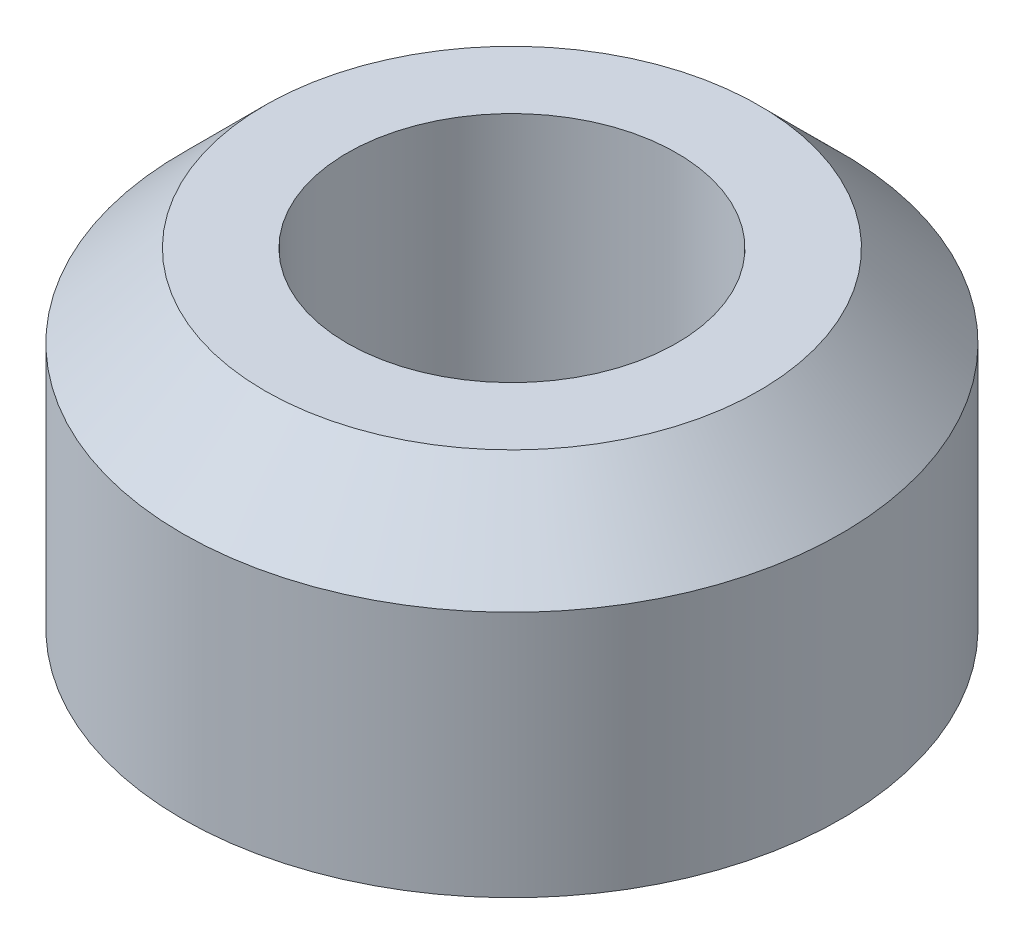
ISO-10303-21;
HEADER;
FILE_DESCRIPTION(('STEP AP214'),'2;1');
FILE_NAME('part.step','',(''),(''),'','','');
FILE_SCHEMA(('AUTOMOTIVE_DESIGN { 1 0 10303 214 1 1 1 1 }'));
ENDSEC;
DATA;
#1=APPLICATION_CONTEXT('core data for automotive mechanical design processes');
#2=APPLICATION_PROTOCOL_DEFINITION('international standard','automotive_design',2000,#1);
#3=PRODUCT_CONTEXT('',#1,'mechanical');
#4=PRODUCT('Part','Part','',(#3));
#5=PRODUCT_RELATED_PRODUCT_CATEGORY('part','',(#4));
#6=PRODUCT_DEFINITION_FORMATION('','',#4);
#7=PRODUCT_DEFINITION_CONTEXT('part definition',#1,'design');
#8=PRODUCT_DEFINITION('design','',#6,#7);
#9=PRODUCT_DEFINITION_SHAPE('','',#8);
#10=(LENGTH_UNIT() NAMED_UNIT(*) SI_UNIT(.MILLI.,.METRE.));
#11=(NAMED_UNIT(*) PLANE_ANGLE_UNIT() SI_UNIT($,.RADIAN.));
#12=(NAMED_UNIT(*) SI_UNIT($,.STERADIAN.) SOLID_ANGLE_UNIT());
#13=UNCERTAINTY_MEASURE_WITH_UNIT(LENGTH_MEASURE(1.E-05),#10,'distance_accuracy_value','');
#14=(GEOMETRIC_REPRESENTATION_CONTEXT(3) GLOBAL_UNCERTAINTY_ASSIGNED_CONTEXT((#13)) GLOBAL_UNIT_ASSIGNED_CONTEXT((#10,
#11,#12)) REPRESENTATION_CONTEXT('',''));
#15=CARTESIAN_POINT('',(0.,0.,0.));
#16=DIRECTION('',(0.,0.,1.));
#17=DIRECTION('',(1.,0.,0.));
#18=AXIS2_PLACEMENT_3D('',#15,#16,#17);
#19=CARTESIAN_POINT('',(0.,6.35,0.));
#20=DIRECTION('',(0.,1.,0.));
#21=DIRECTION('',(0.,0.,1.));
#22=AXIS2_PLACEMENT_3D('',#19,#20,#21);
#23=CYLINDRICAL_SURFACE('',#22,3.175);
#24=CARTESIAN_POINT('',(0.,6.35,0.));
#25=DIRECTION('',(0.,1.,0.));
#26=DIRECTION('',(0.,0.,1.));
#27=AXIS2_PLACEMENT_3D('',#24,#25,#26);
#28=CIRCLE('',#27,3.175);
#29=CARTESIAN_POINT('',(0.,6.35,3.175));
#30=VERTEX_POINT('',#29);
#31=EDGE_CURVE('E51',#30,#30,#28,.T.);
#32=ORIENTED_EDGE('',*,*,#31,.T.);
#33=EDGE_LOOP('',(#32));
#34=FACE_BOUND('',#33,.T.);
#35=CARTESIAN_POINT('',(0.,0.,0.));
#36=DIRECTION('',(0.,1.,0.));
#37=DIRECTION('',(0.,0.,1.));
#38=AXIS2_PLACEMENT_3D('',#35,#36,#37);
#39=CIRCLE('',#38,3.175);
#40=CARTESIAN_POINT('',(0.,0.,3.175));
#41=VERTEX_POINT('',#40);
#42=EDGE_CURVE('E10',#41,#41,#39,.T.);
#43=ORIENTED_EDGE('',*,*,#42,.F.);
#44=EDGE_LOOP('',(#43));
#45=FACE_BOUND('',#44,.T.);
#46=ADVANCED_FACE('F32',(#34,#45),#23,.F.);
#47=CARTESIAN_POINT('',(3.175,0.,0.));
#48=DIRECTION('',(0.,1.,0.));
#49=DIRECTION('',(0.,0.,1.));
#50=AXIS2_PLACEMENT_3D('',#47,#48,#49);
#51=PLANE('',#50);
#52=CARTESIAN_POINT('',(0.,0.,0.));
#53=DIRECTION('',(0.,1.,0.));
#54=DIRECTION('',(0.,0.,1.));
#55=AXIS2_PLACEMENT_3D('',#52,#53,#54);
#56=CIRCLE('',#55,6.35);
#57=CARTESIAN_POINT('',(0.,0.,6.35));
#58=VERTEX_POINT('',#57);
#59=EDGE_CURVE('E38',#58,#58,#56,.T.);
#60=ORIENTED_EDGE('',*,*,#59,.F.);
#61=EDGE_LOOP('',(#60));
#62=FACE_BOUND('',#61,.T.);
#63=ORIENTED_EDGE('',*,*,#42,.T.);
#64=EDGE_LOOP('',(#63));
#65=FACE_BOUND('',#64,.T.);
#66=ADVANCED_FACE('F71',(#62,#65),#51,.F.);
#67=CARTESIAN_POINT('',(0.,6.35,0.));
#68=DIRECTION('',(0.,1.,0.));
#69=DIRECTION('',(0.,0.,1.));
#70=AXIS2_PLACEMENT_3D('',#67,#68,#69);
#71=CYLINDRICAL_SURFACE('',#70,6.35);
#72=CARTESIAN_POINT('',(0.,4.7625,0.));
#73=DIRECTION('',(0.,1.,0.));
#74=DIRECTION('',(0.,0.,1.));
#75=AXIS2_PLACEMENT_3D('',#72,#73,#74);
#76=CIRCLE('',#75,6.35);
#77=CARTESIAN_POINT('',(0.,4.7625,6.35));
#78=VERTEX_POINT('',#77);
#79=EDGE_CURVE('E42',#78,#78,#76,.T.);
#80=ORIENTED_EDGE('',*,*,#79,.F.);
#81=EDGE_LOOP('',(#80));
#82=FACE_BOUND('',#81,.T.);
#83=ORIENTED_EDGE('',*,*,#59,.T.);
#84=EDGE_LOOP('',(#83));
#85=FACE_BOUND('',#84,.T.);
#86=ADVANCED_FACE('F66',(#82,#85),#71,.T.);
#87=CARTESIAN_POINT('',(0.,4.7625,0.));
#88=DIRECTION('',(0.,-1.,0.));
#89=DIRECTION('',(0.,0.,-1.));
#90=AXIS2_PLACEMENT_3D('',#87,#88,#89);
#91=CONICAL_SURFACE('',#90,6.35,0.785398163397449);
#92=CARTESIAN_POINT('',(0.,6.35,0.));
#93=DIRECTION('',(0.,1.,0.));
#94=DIRECTION('',(0.,0.,1.));
#95=AXIS2_PLACEMENT_3D('',#92,#93,#94);
#96=CIRCLE('',#95,4.7625);
#97=CARTESIAN_POINT('',(0.,6.35,4.7625));
#98=VERTEX_POINT('',#97);
#99=EDGE_CURVE('E46',#98,#98,#96,.T.);
#100=ORIENTED_EDGE('',*,*,#99,.F.);
#101=EDGE_LOOP('',(#100));
#102=FACE_BOUND('',#101,.T.);
#103=ORIENTED_EDGE('',*,*,#79,.T.);
#104=EDGE_LOOP('',(#103));
#105=FACE_BOUND('',#104,.T.);
#106=ADVANCED_FACE('F60',(#102,#105),#91,.T.);
#107=CARTESIAN_POINT('',(4.7625,6.35,0.));
#108=DIRECTION('',(0.,-1.,0.));
#109=DIRECTION('',(0.,0.,-1.));
#110=AXIS2_PLACEMENT_3D('',#107,#108,#109);
#111=PLANE('',#110);
#112=ORIENTED_EDGE('',*,*,#31,.F.);
#113=EDGE_LOOP('',(#112));
#114=FACE_BOUND('',#113,.T.);
#115=ORIENTED_EDGE('',*,*,#99,.T.);
#116=EDGE_LOOP('',(#115));
#117=FACE_BOUND('',#116,.T.);
#118=ADVANCED_FACE('F57',(#114,#117),#111,.F.);
#119=CLOSED_SHELL('',(#46,#66,#86,#106,#118));
#120=MANIFOLD_SOLID_BREP('B2',#119);
#121=ADVANCED_BREP_SHAPE_REPRESENTATION('',(#18,#120),#14);
#122=SHAPE_DEFINITION_REPRESENTATION(#9,#121);
ENDSEC;
END-ISO-10303-21;
